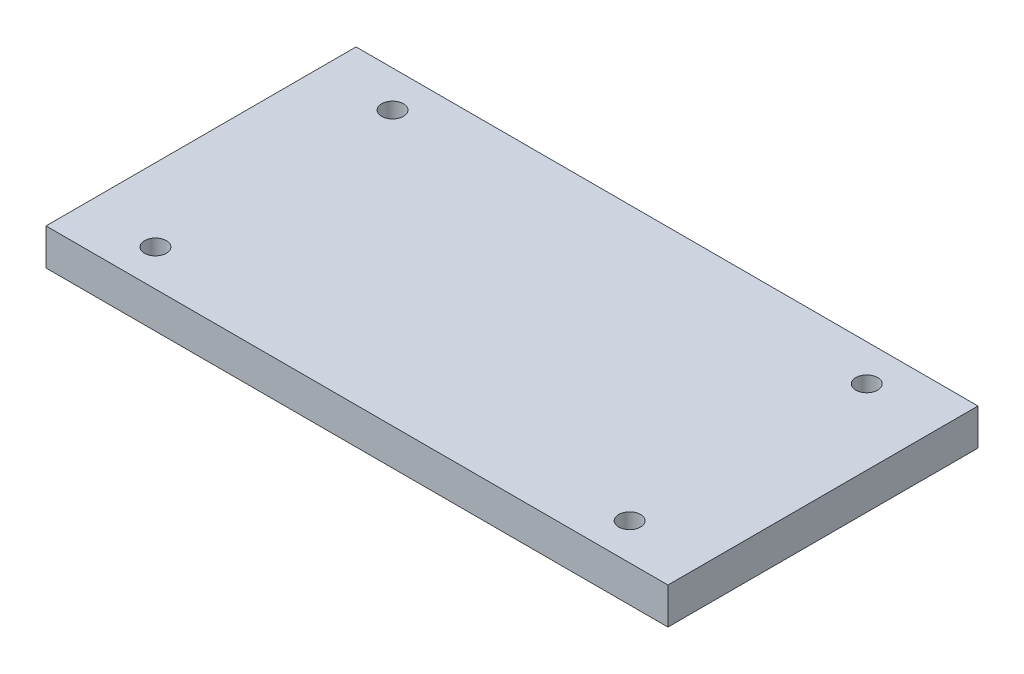
ISO-10303-21;
HEADER;
FILE_DESCRIPTION(('STEP AP214'),'2;1');
FILE_NAME('part.step','',(''),(''),'','','');
FILE_SCHEMA(('AUTOMOTIVE_DESIGN { 1 0 10303 214 1 1 1 1 }'));
ENDSEC;
DATA;
#1=APPLICATION_CONTEXT('core data for automotive mechanical design processes');
#2=APPLICATION_PROTOCOL_DEFINITION('international standard','automotive_design',2000,#1);
#3=PRODUCT_CONTEXT('',#1,'mechanical');
#4=PRODUCT('Part','Part','',(#3));
#5=PRODUCT_RELATED_PRODUCT_CATEGORY('part','',(#4));
#6=PRODUCT_DEFINITION_FORMATION('','',#4);
#7=PRODUCT_DEFINITION_CONTEXT('part definition',#1,'design');
#8=PRODUCT_DEFINITION('design','',#6,#7);
#9=PRODUCT_DEFINITION_SHAPE('','',#8);
#10=(LENGTH_UNIT() NAMED_UNIT(*) SI_UNIT(.MILLI.,.METRE.));
#11=(NAMED_UNIT(*) PLANE_ANGLE_UNIT() SI_UNIT($,.RADIAN.));
#12=(NAMED_UNIT(*) SI_UNIT($,.STERADIAN.) SOLID_ANGLE_UNIT());
#13=UNCERTAINTY_MEASURE_WITH_UNIT(LENGTH_MEASURE(1.E-05),#10,'distance_accuracy_value','');
#14=(GEOMETRIC_REPRESENTATION_CONTEXT(3) GLOBAL_UNCERTAINTY_ASSIGNED_CONTEXT((#13)) GLOBAL_UNIT_ASSIGNED_CONTEXT((#10,
#11,#12)) REPRESENTATION_CONTEXT('',''));
#15=CARTESIAN_POINT('',(0.,0.,0.));
#16=DIRECTION('',(0.,0.,1.));
#17=DIRECTION('',(1.,0.,0.));
#18=AXIS2_PLACEMENT_3D('',#15,#16,#17);
#19=CARTESIAN_POINT('',(0.,10.,0.));
#20=DIRECTION('',(0.,1.,0.));
#21=DIRECTION('',(0.,0.,1.));
#22=AXIS2_PLACEMENT_3D('',#19,#20,#21);
#23=PLANE('',#22);
#24=CARTESIAN_POINT('',(150.,10.,-75.));
#25=DIRECTION('',(0.,1.,0.));
#26=DIRECTION('',(0.,0.,1.));
#27=AXIS2_PLACEMENT_3D('',#24,#25,#26);
#28=CIRCLE('',#27,2.99999999999999);
#29=CARTESIAN_POINT('',(150.,10.,-72.));
#30=VERTEX_POINT('',#29);
#31=EDGE_CURVE('E142',#30,#30,#28,.T.);
#32=ORIENTED_EDGE('',*,*,#31,.F.);
#33=EDGE_LOOP('',(#32));
#34=FACE_BOUND('',#33,.T.);
#35=CARTESIAN_POINT('',(20.,10.,-10.));
#36=DIRECTION('',(0.,1.,0.));
#37=DIRECTION('',(0.,0.,1.));
#38=AXIS2_PLACEMENT_3D('',#35,#36,#37);
#39=CIRCLE('',#38,3.);
#40=CARTESIAN_POINT('',(20.,10.,-7.));
#41=VERTEX_POINT('',#40);
#42=EDGE_CURVE('E112',#41,#41,#39,.T.);
#43=ORIENTED_EDGE('',*,*,#42,.F.);
#44=EDGE_LOOP('',(#43));
#45=FACE_BOUND('',#44,.T.);
#46=DIRECTION('',(0.,0.,1.));
#47=VECTOR('',#46,1.);
#48=CARTESIAN_POINT('',(0.,10.,-85.));
#49=LINE('',#48,#47);
#50=CARTESIAN_POINT('',(0.,10.,-85.));
#51=VERTEX_POINT('',#50);
#52=CARTESIAN_POINT('',(0.,10.,0.));
#53=VERTEX_POINT('',#52);
#54=EDGE_CURVE('E92',#51,#53,#49,.T.);
#55=ORIENTED_EDGE('',*,*,#54,.T.);
#56=DIRECTION('',(1.,0.,0.));
#57=VECTOR('',#56,1.);
#58=CARTESIAN_POINT('',(0.,10.,0.));
#59=LINE('',#58,#57);
#60=CARTESIAN_POINT('',(170.5,10.,0.));
#61=VERTEX_POINT('',#60);
#62=EDGE_CURVE('E87',#53,#61,#59,.T.);
#63=ORIENTED_EDGE('',*,*,#62,.T.);
#64=DIRECTION('',(0.,0.,-1.));
#65=VECTOR('',#64,1.);
#66=CARTESIAN_POINT('',(170.5,10.,-85.));
#67=LINE('',#66,#65);
#68=CARTESIAN_POINT('',(170.5,10.,-85.));
#69=VERTEX_POINT('',#68);
#70=EDGE_CURVE('E90',#61,#69,#67,.T.);
#71=ORIENTED_EDGE('',*,*,#70,.T.);
#72=DIRECTION('',(-1.,0.,0.));
#73=VECTOR('',#72,1.);
#74=CARTESIAN_POINT('',(0.,10.,-85.));
#75=LINE('',#74,#73);
#76=EDGE_CURVE('E57',#69,#51,#75,.T.);
#77=ORIENTED_EDGE('',*,*,#76,.T.);
#78=EDGE_LOOP('',(#55,#63,#71,#77));
#79=FACE_BOUND('',#78,.T.);
#80=CARTESIAN_POINT('',(150.,10.,-10.));
#81=DIRECTION('',(0.,1.,0.));
#82=DIRECTION('',(0.,0.,1.));
#83=AXIS2_PLACEMENT_3D('',#80,#81,#82);
#84=CIRCLE('',#83,2.99999999999999);
#85=CARTESIAN_POINT('',(150.,10.,-7.00000000000001));
#86=VERTEX_POINT('',#85);
#87=EDGE_CURVE('E134',#86,#86,#84,.T.);
#88=ORIENTED_EDGE('',*,*,#87,.F.);
#89=EDGE_LOOP('',(#88));
#90=FACE_BOUND('',#89,.T.);
#91=CARTESIAN_POINT('',(20.,10.,-75.));
#92=DIRECTION('',(0.,1.,0.));
#93=DIRECTION('',(0.,0.,1.));
#94=AXIS2_PLACEMENT_3D('',#91,#92,#93);
#95=CIRCLE('',#94,3.);
#96=CARTESIAN_POINT('',(20.,10.,-72.));
#97=VERTEX_POINT('',#96);
#98=EDGE_CURVE('E150',#97,#97,#95,.T.);
#99=ORIENTED_EDGE('',*,*,#98,.F.);
#100=EDGE_LOOP('',(#99));
#101=FACE_BOUND('',#100,.T.);
#102=ADVANCED_FACE('F39',(#34,#45,#79,#90,#101),#23,.T.);
#103=CARTESIAN_POINT('',(0.,0.,0.));
#104=DIRECTION('',(0.,1.,0.));
#105=DIRECTION('',(0.,0.,1.));
#106=AXIS2_PLACEMENT_3D('',#103,#104,#105);
#107=PLANE('',#106);
#108=DIRECTION('',(0.,0.,1.));
#109=VECTOR('',#108,1.);
#110=CARTESIAN_POINT('',(0.,0.,-85.));
#111=LINE('',#110,#109);
#112=CARTESIAN_POINT('',(0.,0.,-85.));
#113=VERTEX_POINT('',#112);
#114=CARTESIAN_POINT('',(0.,0.,0.));
#115=VERTEX_POINT('',#114);
#116=EDGE_CURVE('E108',#113,#115,#111,.T.);
#117=ORIENTED_EDGE('',*,*,#116,.F.);
#118=DIRECTION('',(-1.,0.,0.));
#119=VECTOR('',#118,1.);
#120=CARTESIAN_POINT('',(0.,0.,-85.));
#121=LINE('',#120,#119);
#122=CARTESIAN_POINT('',(170.5,0.,-85.));
#123=VERTEX_POINT('',#122);
#124=EDGE_CURVE('E80',#123,#113,#121,.T.);
#125=ORIENTED_EDGE('',*,*,#124,.F.);
#126=DIRECTION('',(0.,0.,-1.));
#127=VECTOR('',#126,1.);
#128=CARTESIAN_POINT('',(170.5,0.,-85.));
#129=LINE('',#128,#127);
#130=CARTESIAN_POINT('',(170.5,0.,0.));
#131=VERTEX_POINT('',#130);
#132=EDGE_CURVE('E74',#131,#123,#129,.T.);
#133=ORIENTED_EDGE('',*,*,#132,.F.);
#134=DIRECTION('',(1.,0.,0.));
#135=VECTOR('',#134,1.);
#136=CARTESIAN_POINT('',(0.,0.,0.));
#137=LINE('',#136,#135);
#138=EDGE_CURVE('E97',#115,#131,#137,.T.);
#139=ORIENTED_EDGE('',*,*,#138,.F.);
#140=EDGE_LOOP('',(#117,#125,#133,#139));
#141=FACE_BOUND('',#140,.T.);
#142=CARTESIAN_POINT('',(20.,0.,-10.));
#143=DIRECTION('',(0.,1.,0.));
#144=DIRECTION('',(0.,0.,1.));
#145=AXIS2_PLACEMENT_3D('',#142,#143,#144);
#146=CIRCLE('',#145,3.);
#147=CARTESIAN_POINT('',(20.,0.,-7.));
#148=VERTEX_POINT('',#147);
#149=EDGE_CURVE('E130',#148,#148,#146,.T.);
#150=ORIENTED_EDGE('',*,*,#149,.T.);
#151=EDGE_LOOP('',(#150));
#152=FACE_BOUND('',#151,.T.);
#153=CARTESIAN_POINT('',(150.,0.,-10.));
#154=DIRECTION('',(0.,1.,0.));
#155=DIRECTION('',(0.,0.,1.));
#156=AXIS2_PLACEMENT_3D('',#153,#154,#155);
#157=CIRCLE('',#156,2.99999999999999);
#158=CARTESIAN_POINT('',(150.,0.,-7.00000000000001));
#159=VERTEX_POINT('',#158);
#160=EDGE_CURVE('E138',#159,#159,#157,.T.);
#161=ORIENTED_EDGE('',*,*,#160,.T.);
#162=EDGE_LOOP('',(#161));
#163=FACE_BOUND('',#162,.T.);
#164=CARTESIAN_POINT('',(150.,0.,-75.));
#165=DIRECTION('',(0.,1.,0.));
#166=DIRECTION('',(0.,0.,1.));
#167=AXIS2_PLACEMENT_3D('',#164,#165,#166);
#168=CIRCLE('',#167,2.99999999999999);
#169=CARTESIAN_POINT('',(150.,0.,-72.));
#170=VERTEX_POINT('',#169);
#171=EDGE_CURVE('E146',#170,#170,#168,.T.);
#172=ORIENTED_EDGE('',*,*,#171,.T.);
#173=EDGE_LOOP('',(#172));
#174=FACE_BOUND('',#173,.T.);
#175=CARTESIAN_POINT('',(20.,0.,-75.));
#176=DIRECTION('',(0.,1.,0.));
#177=DIRECTION('',(0.,0.,1.));
#178=AXIS2_PLACEMENT_3D('',#175,#176,#177);
#179=CIRCLE('',#178,3.);
#180=CARTESIAN_POINT('',(20.,0.,-72.));
#181=VERTEX_POINT('',#180);
#182=EDGE_CURVE('E154',#181,#181,#179,.T.);
#183=ORIENTED_EDGE('',*,*,#182,.T.);
#184=EDGE_LOOP('',(#183));
#185=FACE_BOUND('',#184,.T.);
#186=ADVANCED_FACE('F125',(#141,#152,#163,#174,#185),#107,.F.);
#187=CARTESIAN_POINT('',(0.,10.,-85.));
#188=DIRECTION('',(1.,0.,0.));
#189=DIRECTION('',(0.,0.,-1.));
#190=AXIS2_PLACEMENT_3D('',#187,#188,#189);
#191=PLANE('',#190);
#192=ORIENTED_EDGE('',*,*,#116,.T.);
#193=DIRECTION('',(0.,-1.,0.));
#194=VECTOR('',#193,1.);
#195=CARTESIAN_POINT('',(0.,10.,0.));
#196=LINE('',#195,#194);
#197=EDGE_CURVE('E11',#53,#115,#196,.T.);
#198=ORIENTED_EDGE('',*,*,#197,.F.);
#199=ORIENTED_EDGE('',*,*,#54,.F.);
#200=DIRECTION('',(0.,-1.,0.));
#201=VECTOR('',#200,1.);
#202=CARTESIAN_POINT('',(0.,10.,-85.));
#203=LINE('',#202,#201);
#204=EDGE_CURVE('E104',#51,#113,#203,.T.);
#205=ORIENTED_EDGE('',*,*,#204,.T.);
#206=EDGE_LOOP('',(#192,#198,#199,#205));
#207=FACE_BOUND('',#206,.T.);
#208=ADVANCED_FACE('F41',(#207),#191,.F.);
#209=CARTESIAN_POINT('',(0.,10.,0.));
#210=DIRECTION('',(0.,0.,-1.));
#211=DIRECTION('',(-1.,0.,0.));
#212=AXIS2_PLACEMENT_3D('',#209,#210,#211);
#213=PLANE('',#212);
#214=ORIENTED_EDGE('',*,*,#138,.T.);
#215=DIRECTION('',(0.,-1.,0.));
#216=VECTOR('',#215,1.);
#217=CARTESIAN_POINT('',(170.5,10.,0.));
#218=LINE('',#217,#216);
#219=EDGE_CURVE('E49',#61,#131,#218,.T.);
#220=ORIENTED_EDGE('',*,*,#219,.F.);
#221=ORIENTED_EDGE('',*,*,#62,.F.);
#222=ORIENTED_EDGE('',*,*,#197,.T.);
#223=EDGE_LOOP('',(#214,#220,#221,#222));
#224=FACE_BOUND('',#223,.T.);
#225=ADVANCED_FACE('F96',(#224),#213,.F.);
#226=CARTESIAN_POINT('',(170.5,10.,-85.));
#227=DIRECTION('',(-1.,0.,0.));
#228=DIRECTION('',(0.,0.,1.));
#229=AXIS2_PLACEMENT_3D('',#226,#227,#228);
#230=PLANE('',#229);
#231=ORIENTED_EDGE('',*,*,#132,.T.);
#232=DIRECTION('',(0.,-1.,0.));
#233=VECTOR('',#232,1.);
#234=CARTESIAN_POINT('',(170.5,10.,-85.));
#235=LINE('',#234,#233);
#236=EDGE_CURVE('E99',#69,#123,#235,.T.);
#237=ORIENTED_EDGE('',*,*,#236,.F.);
#238=ORIENTED_EDGE('',*,*,#70,.F.);
#239=ORIENTED_EDGE('',*,*,#219,.T.);
#240=EDGE_LOOP('',(#231,#237,#238,#239));
#241=FACE_BOUND('',#240,.T.);
#242=ADVANCED_FACE('F100',(#241),#230,.F.);
#243=CARTESIAN_POINT('',(0.,10.,-85.));
#244=DIRECTION('',(0.,0.,1.));
#245=DIRECTION('',(1.,0.,0.));
#246=AXIS2_PLACEMENT_3D('',#243,#244,#245);
#247=PLANE('',#246);
#248=ORIENTED_EDGE('',*,*,#124,.T.);
#249=ORIENTED_EDGE('',*,*,#204,.F.);
#250=ORIENTED_EDGE('',*,*,#76,.F.);
#251=ORIENTED_EDGE('',*,*,#236,.T.);
#252=EDGE_LOOP('',(#248,#249,#250,#251));
#253=FACE_BOUND('',#252,.T.);
#254=ADVANCED_FACE('F122',(#253),#247,.F.);
#255=CARTESIAN_POINT('',(20.,10.,-10.));
#256=DIRECTION('',(0.,-1.,0.));
#257=DIRECTION('',(0.,0.,-1.));
#258=AXIS2_PLACEMENT_3D('',#255,#256,#257);
#259=CYLINDRICAL_SURFACE('',#258,3.);
#260=ORIENTED_EDGE('',*,*,#42,.T.);
#261=EDGE_LOOP('',(#260));
#262=FACE_BOUND('',#261,.T.);
#263=ORIENTED_EDGE('',*,*,#149,.F.);
#264=EDGE_LOOP('',(#263));
#265=FACE_BOUND('',#264,.T.);
#266=ADVANCED_FACE('F175',(#262,#265),#259,.F.);
#267=CARTESIAN_POINT('',(150.,10.,-10.));
#268=DIRECTION('',(0.,-1.,0.));
#269=DIRECTION('',(0.,0.,-1.));
#270=AXIS2_PLACEMENT_3D('',#267,#268,#269);
#271=CYLINDRICAL_SURFACE('',#270,2.99999999999999);
#272=ORIENTED_EDGE('',*,*,#87,.T.);
#273=EDGE_LOOP('',(#272));
#274=FACE_BOUND('',#273,.T.);
#275=ORIENTED_EDGE('',*,*,#160,.F.);
#276=EDGE_LOOP('',(#275));
#277=FACE_BOUND('',#276,.T.);
#278=ADVANCED_FACE('F221',(#274,#277),#271,.F.);
#279=CARTESIAN_POINT('',(150.,10.,-75.));
#280=DIRECTION('',(0.,-1.,0.));
#281=DIRECTION('',(0.,0.,-1.));
#282=AXIS2_PLACEMENT_3D('',#279,#280,#281);
#283=CYLINDRICAL_SURFACE('',#282,2.99999999999999);
#284=ORIENTED_EDGE('',*,*,#31,.T.);
#285=EDGE_LOOP('',(#284));
#286=FACE_BOUND('',#285,.T.);
#287=ORIENTED_EDGE('',*,*,#171,.F.);
#288=EDGE_LOOP('',(#287));
#289=FACE_BOUND('',#288,.T.);
#290=ADVANCED_FACE('F229',(#286,#289),#283,.F.);
#291=CARTESIAN_POINT('',(20.,10.,-75.));
#292=DIRECTION('',(0.,-1.,0.));
#293=DIRECTION('',(0.,0.,-1.));
#294=AXIS2_PLACEMENT_3D('',#291,#292,#293);
#295=CYLINDRICAL_SURFACE('',#294,3.);
#296=ORIENTED_EDGE('',*,*,#98,.T.);
#297=EDGE_LOOP('',(#296));
#298=FACE_BOUND('',#297,.T.);
#299=ORIENTED_EDGE('',*,*,#182,.F.);
#300=EDGE_LOOP('',(#299));
#301=FACE_BOUND('',#300,.T.);
#302=ADVANCED_FACE('F162',(#298,#301),#295,.F.);
#303=CLOSED_SHELL('',(#102,#186,#208,#225,#242,#254,#266,#278,#290,#302));
#304=MANIFOLD_SOLID_BREP('B2',#303);
#305=ADVANCED_BREP_SHAPE_REPRESENTATION('',(#18,#304),#14);
#306=SHAPE_DEFINITION_REPRESENTATION(#9,#305);
ENDSEC;
END-ISO-10303-21;
